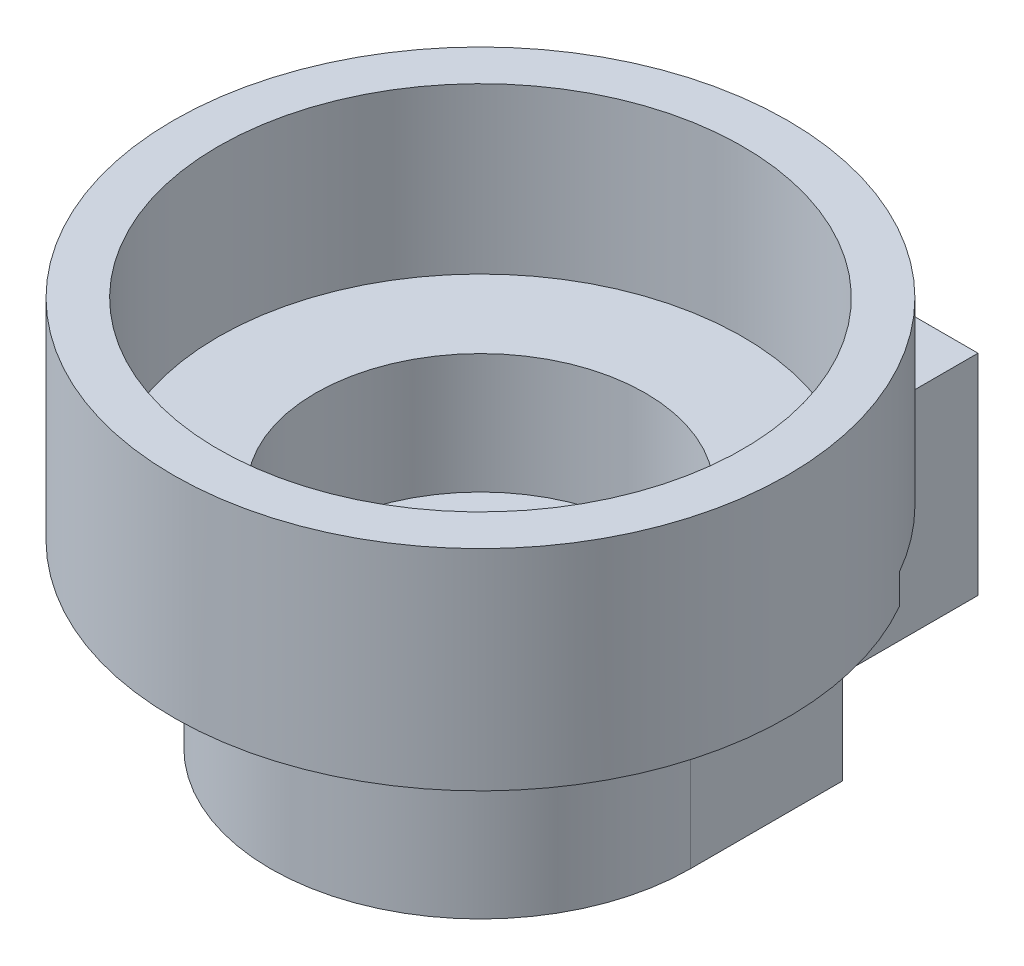
ISO-10303-21;
HEADER;
FILE_DESCRIPTION(('STEP AP214'),'2;1');
FILE_NAME('part.step','',(''),(''),'','','');
FILE_SCHEMA(('AUTOMOTIVE_DESIGN { 1 0 10303 214 1 1 1 1 }'));
ENDSEC;
DATA;
#1=APPLICATION_CONTEXT('core data for automotive mechanical design processes');
#2=APPLICATION_PROTOCOL_DEFINITION('international standard','automotive_design',2000,#1);
#3=PRODUCT_CONTEXT('',#1,'mechanical');
#4=PRODUCT('Part','Part','',(#3));
#5=PRODUCT_RELATED_PRODUCT_CATEGORY('part','',(#4));
#6=PRODUCT_DEFINITION_FORMATION('','',#4);
#7=PRODUCT_DEFINITION_CONTEXT('part definition',#1,'design');
#8=PRODUCT_DEFINITION('design','',#6,#7);
#9=PRODUCT_DEFINITION_SHAPE('','',#8);
#10=(LENGTH_UNIT() NAMED_UNIT(*) SI_UNIT(.MILLI.,.METRE.));
#11=(NAMED_UNIT(*) PLANE_ANGLE_UNIT() SI_UNIT($,.RADIAN.));
#12=(NAMED_UNIT(*) SI_UNIT($,.STERADIAN.) SOLID_ANGLE_UNIT());
#13=UNCERTAINTY_MEASURE_WITH_UNIT(LENGTH_MEASURE(1.E-05),#10,'distance_accuracy_value','');
#14=(GEOMETRIC_REPRESENTATION_CONTEXT(3) GLOBAL_UNCERTAINTY_ASSIGNED_CONTEXT((#13)) GLOBAL_UNIT_ASSIGNED_CONTEXT((#10,
#11,#12)) REPRESENTATION_CONTEXT('',''));
#15=CARTESIAN_POINT('',(0.,0.,0.));
#16=DIRECTION('',(0.,0.,1.));
#17=DIRECTION('',(1.,0.,0.));
#18=AXIS2_PLACEMENT_3D('',#15,#16,#17);
#19=CARTESIAN_POINT('',(-14.000000152,-37.8042327924268,-25.4));
#20=DIRECTION('',(0.,0.,1.));
#21=DIRECTION('',(1.,0.,0.));
#22=AXIS2_PLACEMENT_3D('',#19,#20,#21);
#23=PLANE('',#22);
#24=DIRECTION('',(0.,-1.,0.));
#25=VECTOR('',#24,1.);
#26=CARTESIAN_POINT('',(7.800000084,13.999999876,-25.4));
#27=LINE('',#26,#25);
#28=CARTESIAN_POINT('',(7.800000084,13.999999876,-25.4));
#29=VERTEX_POINT('',#28);
#30=CARTESIAN_POINT('',(7.800000084,0.,-25.4));
#31=VERTEX_POINT('',#30);
#32=EDGE_CURVE('E121',#29,#31,#27,.T.);
#33=ORIENTED_EDGE('',*,*,#32,.T.);
#34=DIRECTION('',(1.,0.,0.));
#35=VECTOR('',#34,1.);
#36=CARTESIAN_POINT('',(-14.000000152,0.,-25.4));
#37=LINE('',#36,#35);
#38=CARTESIAN_POINT('',(-7.800000084,0.,-25.4));
#39=VERTEX_POINT('',#38);
#40=EDGE_CURVE('E170',#39,#31,#37,.T.);
#41=ORIENTED_EDGE('',*,*,#40,.F.);
#42=DIRECTION('',(0.,-1.,0.));
#43=VECTOR('',#42,1.);
#44=CARTESIAN_POINT('',(-7.800000084,13.999999876,-25.4));
#45=LINE('',#44,#43);
#46=CARTESIAN_POINT('',(-7.800000084,13.999999876,-25.4));
#47=VERTEX_POINT('',#46);
#48=EDGE_CURVE('E146',#47,#39,#45,.T.);
#49=ORIENTED_EDGE('',*,*,#48,.F.);
#50=DIRECTION('',(-1.,0.,0.));
#51=VECTOR('',#50,1.);
#52=CARTESIAN_POINT('',(14.000000152,13.999999876,-25.4));
#53=LINE('',#52,#51);
#54=EDGE_CURVE('E140',#29,#47,#53,.T.);
#55=ORIENTED_EDGE('',*,*,#54,.F.);
#56=EDGE_LOOP('',(#33,#41,#49,#55));
#57=FACE_BOUND('',#56,.T.);
#58=ADVANCED_FACE('F37',(#57),#23,.F.);
#59=CARTESIAN_POINT('',(0.,13.999999876,0.));
#60=DIRECTION('',(0.,1.,0.));
#61=DIRECTION('',(0.,0.,1.));
#62=AXIS2_PLACEMENT_3D('',#59,#60,#61);
#63=PLANE('',#62);
#64=CARTESIAN_POINT('',(0.,13.999999876,0.));
#65=DIRECTION('',(0.,-1.,0.));
#66=DIRECTION('',(0.,0.,1.));
#67=AXIS2_PLACEMENT_3D('',#64,#65,#66);
#68=CIRCLE('',#67,20.500000052);
#69=CARTESIAN_POINT('',(-7.800000084,13.999999876,-18.9581117419853));
#70=VERTEX_POINT('',#69);
#71=CARTESIAN_POINT('',(7.800000084,13.999999876,-18.9581117419853));
#72=VERTEX_POINT('',#71);
#73=EDGE_CURVE('E142',#70,#72,#68,.T.);
#74=ORIENTED_EDGE('',*,*,#73,.T.);
#75=DIRECTION('',(0.,0.,-1.));
#76=VECTOR('',#75,1.);
#77=CARTESIAN_POINT('',(7.80000008400001,13.999999876,-10.16));
#78=LINE('',#77,#76);
#79=EDGE_CURVE('E126',#72,#29,#78,.T.);
#80=ORIENTED_EDGE('',*,*,#79,.T.);
#81=ORIENTED_EDGE('',*,*,#54,.T.);
#82=DIRECTION('',(0.,0.,1.));
#83=VECTOR('',#82,1.);
#84=CARTESIAN_POINT('',(-7.80000008400001,13.999999876,0.));
#85=LINE('',#84,#83);
#86=EDGE_CURVE('E207',#47,#70,#85,.T.);
#87=ORIENTED_EDGE('',*,*,#86,.T.);
#88=EDGE_LOOP('',(#74,#80,#81,#87));
#89=FACE_BOUND('',#88,.T.);
#90=ADVANCED_FACE('F138',(#89),#63,.T.);
#91=CARTESIAN_POINT('',(0.,6.999999906,0.));
#92=DIRECTION('',(0.,1.,0.));
#93=DIRECTION('',(-1.,0.,0.));
#94=AXIS2_PLACEMENT_3D('',#91,#92,#93);
#95=CYLINDRICAL_SURFACE('',#94,20.500000052);
#96=CARTESIAN_POINT('',(0.,25.999999876,0.));
#97=DIRECTION('',(0.,1.,0.));
#98=DIRECTION('',(-1.,0.,0.));
#99=AXIS2_PLACEMENT_3D('',#96,#97,#98);
#100=CIRCLE('',#99,20.500000052);
#101=CARTESIAN_POINT('',(-20.500000052,25.999999876,0.));
#102=VERTEX_POINT('',#101);
#103=EDGE_CURVE('E195',#102,#102,#100,.T.);
#104=ORIENTED_EDGE('',*,*,#103,.F.);
#105=EDGE_LOOP('',(#104));
#106=FACE_BOUND('',#105,.T.);
#107=CARTESIAN_POINT('',(0.,11.999999876,0.));
#108=DIRECTION('',(0.,1.,0.));
#109=DIRECTION('',(-1.,0.,0.));
#110=AXIS2_PLACEMENT_3D('',#107,#108,#109);
#111=CIRCLE('',#110,20.500000052);
#112=CARTESIAN_POINT('',(-17.8051790817167,11.999999876,-10.16));
#113=VERTEX_POINT('',#112);
#114=CARTESIAN_POINT('',(17.8051790817166,11.999999876,-10.16));
#115=VERTEX_POINT('',#114);
#116=EDGE_CURVE('E198',#113,#115,#111,.T.);
#117=ORIENTED_EDGE('',*,*,#116,.T.);
#118=DIRECTION('',(0.,1.,0.));
#119=VECTOR('',#118,1.);
#120=CARTESIAN_POINT('',(17.8051790817167,6.999999906,-10.16));
#121=LINE('',#120,#119);
#122=CARTESIAN_POINT('',(17.8051790817166,13.999999876,-10.16));
#123=VERTEX_POINT('',#122);
#124=EDGE_CURVE('E323',#115,#123,#121,.T.);
#125=ORIENTED_EDGE('',*,*,#124,.T.);
#126=CARTESIAN_POINT('',(0.,13.999999876,0.));
#127=DIRECTION('',(0.,-1.,0.));
#128=DIRECTION('',(0.,0.,-1.));
#129=AXIS2_PLACEMENT_3D('',#126,#127,#128);
#130=CIRCLE('',#129,20.500000052);
#131=EDGE_CURVE('E320',#123,#72,#130,.F.);
#132=ORIENTED_EDGE('',*,*,#131,.T.);
#133=ORIENTED_EDGE('',*,*,#73,.F.);
#134=CARTESIAN_POINT('',(-17.8051790817167,13.999999876,-10.16));
#135=VERTEX_POINT('',#134);
#136=EDGE_CURVE('E148',#135,#70,#68,.T.);
#137=ORIENTED_EDGE('',*,*,#136,.F.);
#138=DIRECTION('',(0.,1.,0.));
#139=VECTOR('',#138,1.);
#140=CARTESIAN_POINT('',(-17.8051790817167,6.999999906,-10.16));
#141=LINE('',#140,#139);
#142=EDGE_CURVE('E340',#113,#135,#141,.T.);
#143=ORIENTED_EDGE('',*,*,#142,.F.);
#144=EDGE_LOOP('',(#117,#125,#132,#133,#137,#143));
#145=FACE_BOUND('',#144,.T.);
#146=ADVANCED_FACE('F249',(#106,#145),#95,.T.);
#147=CARTESIAN_POINT('',(-14.000000152,11.999999876,0.));
#148=DIRECTION('',(0.,-1.,0.));
#149=DIRECTION('',(1.,0.,0.));
#150=AXIS2_PLACEMENT_3D('',#147,#148,#149);
#151=PLANE('',#150);
#152=DIRECTION('',(0.,0.,1.));
#153=VECTOR('',#152,1.);
#154=CARTESIAN_POINT('',(14.000000152,11.999999876,-25.4));
#155=LINE('',#154,#153);
#156=CARTESIAN_POINT('',(14.000000152,11.999999876,-10.16));
#157=VERTEX_POINT('',#156);
#158=CARTESIAN_POINT('',(14.000000152,11.999999876,0.));
#159=VERTEX_POINT('',#158);
#160=EDGE_CURVE('E163',#157,#159,#155,.T.);
#161=ORIENTED_EDGE('',*,*,#160,.F.);
#162=DIRECTION('',(1.,0.,0.));
#163=VECTOR('',#162,1.);
#164=CARTESIAN_POINT('',(-14.000000152,11.999999876,-10.16));
#165=LINE('',#164,#163);
#166=EDGE_CURVE('E51',#157,#115,#165,.T.);
#167=ORIENTED_EDGE('',*,*,#166,.T.);
#168=ORIENTED_EDGE('',*,*,#116,.F.);
#169=DIRECTION('',(-1.,0.,0.));
#170=VECTOR('',#169,1.);
#171=CARTESIAN_POINT('',(-14.000000152,11.999999876,-10.16));
#172=LINE('',#171,#170);
#173=CARTESIAN_POINT('',(-14.000000152,11.999999876,-10.16));
#174=VERTEX_POINT('',#173);
#175=EDGE_CURVE('E299',#174,#113,#172,.T.);
#176=ORIENTED_EDGE('',*,*,#175,.F.);
#177=DIRECTION('',(0.,0.,-1.));
#178=VECTOR('',#177,1.);
#179=CARTESIAN_POINT('',(-14.000000152,11.999999876,0.));
#180=LINE('',#179,#178);
#181=CARTESIAN_POINT('',(-14.000000152,11.999999876,0.));
#182=VERTEX_POINT('',#181);
#183=EDGE_CURVE('E166',#182,#174,#180,.T.);
#184=ORIENTED_EDGE('',*,*,#183,.F.);
#185=CARTESIAN_POINT('',(0.,11.999999876,0.));
#186=DIRECTION('',(0.,1.,0.));
#187=DIRECTION('',(-1.,0.,0.));
#188=AXIS2_PLACEMENT_3D('',#185,#186,#187);
#189=CIRCLE('',#188,14.000000152);
#190=EDGE_CURVE('E201',#182,#159,#189,.T.);
#191=ORIENTED_EDGE('',*,*,#190,.T.);
#192=EDGE_LOOP('',(#161,#167,#168,#176,#184,#191));
#193=FACE_BOUND('',#192,.T.);
#194=ADVANCED_FACE('F281',(#193),#151,.T.);
#195=CARTESIAN_POINT('',(0.,0.,0.));
#196=DIRECTION('',(0.,-1.,0.));
#197=DIRECTION('',(1.,0.,0.));
#198=AXIS2_PLACEMENT_3D('',#195,#196,#197);
#199=PLANE('',#198);
#200=CARTESIAN_POINT('',(0.,0.,-18.1));
#201=DIRECTION('',(0.,-1.,0.));
#202=DIRECTION('',(0.,0.,-1.));
#203=AXIS2_PLACEMENT_3D('',#200,#201,#202);
#204=CIRCLE('',#203,4.62499994);
#205=CARTESIAN_POINT('',(0.,0.,-22.72499994));
#206=VERTEX_POINT('',#205);
#207=EDGE_CURVE('E160',#206,#206,#204,.T.);
#208=ORIENTED_EDGE('',*,*,#207,.F.);
#209=EDGE_LOOP('',(#208));
#210=FACE_BOUND('',#209,.T.);
#211=CARTESIAN_POINT('',(0.,0.,0.));
#212=DIRECTION('',(0.,-1.,0.));
#213=DIRECTION('',(0.,0.,-1.));
#214=AXIS2_PLACEMENT_3D('',#211,#212,#213);
#215=CIRCLE('',#214,4.15);
#216=CARTESIAN_POINT('',(0.,0.,-4.15));
#217=VERTEX_POINT('',#216);
#218=EDGE_CURVE('E172',#217,#217,#215,.T.);
#219=ORIENTED_EDGE('',*,*,#218,.F.);
#220=EDGE_LOOP('',(#219));
#221=FACE_BOUND('',#220,.T.);
#222=DIRECTION('',(0.,0.,1.));
#223=VECTOR('',#222,1.);
#224=CARTESIAN_POINT('',(7.800000084,0.,-25.4));
#225=LINE('',#224,#223);
#226=CARTESIAN_POINT('',(7.80000008400001,0.,-10.16));
#227=VERTEX_POINT('',#226);
#228=EDGE_CURVE('E130',#31,#227,#225,.T.);
#229=ORIENTED_EDGE('',*,*,#228,.T.);
#230=DIRECTION('',(1.,0.,0.));
#231=VECTOR('',#230,1.);
#232=CARTESIAN_POINT('',(7.80000008400001,0.,-10.16));
#233=LINE('',#232,#231);
#234=CARTESIAN_POINT('',(14.000000152,0.,-10.16));
#235=VERTEX_POINT('',#234);
#236=EDGE_CURVE('E307',#227,#235,#233,.T.);
#237=ORIENTED_EDGE('',*,*,#236,.T.);
#238=DIRECTION('',(0.,0.,1.));
#239=VECTOR('',#238,1.);
#240=CARTESIAN_POINT('',(14.000000152,0.,-25.4));
#241=LINE('',#240,#239);
#242=CARTESIAN_POINT('',(14.000000152,0.,0.));
#243=VERTEX_POINT('',#242);
#244=EDGE_CURVE('E165',#235,#243,#241,.T.);
#245=ORIENTED_EDGE('',*,*,#244,.T.);
#246=CARTESIAN_POINT('',(0.,0.,0.));
#247=DIRECTION('',(0.,1.,0.));
#248=DIRECTION('',(-1.,0.,0.));
#249=AXIS2_PLACEMENT_3D('',#246,#247,#248);
#250=CIRCLE('',#249,14.000000152);
#251=CARTESIAN_POINT('',(-14.000000152,0.,0.));
#252=VERTEX_POINT('',#251);
#253=EDGE_CURVE('E204',#252,#243,#250,.T.);
#254=ORIENTED_EDGE('',*,*,#253,.F.);
#255=DIRECTION('',(0.,0.,-1.));
#256=VECTOR('',#255,1.);
#257=CARTESIAN_POINT('',(-14.000000152,0.,0.));
#258=LINE('',#257,#256);
#259=CARTESIAN_POINT('',(-14.000000152,0.,-10.16));
#260=VERTEX_POINT('',#259);
#261=EDGE_CURVE('E173',#252,#260,#258,.T.);
#262=ORIENTED_EDGE('',*,*,#261,.T.);
#263=DIRECTION('',(-1.,0.,0.));
#264=VECTOR('',#263,1.);
#265=CARTESIAN_POINT('',(-7.80000008400001,0.,-10.16));
#266=LINE('',#265,#264);
#267=CARTESIAN_POINT('',(-7.80000008400001,0.,-10.16));
#268=VERTEX_POINT('',#267);
#269=EDGE_CURVE('E304',#268,#260,#266,.T.);
#270=ORIENTED_EDGE('',*,*,#269,.F.);
#271=DIRECTION('',(0.,0.,1.));
#272=VECTOR('',#271,1.);
#273=CARTESIAN_POINT('',(-7.800000084,0.,-25.4));
#274=LINE('',#273,#272);
#275=EDGE_CURVE('E327',#39,#268,#274,.T.);
#276=ORIENTED_EDGE('',*,*,#275,.F.);
#277=ORIENTED_EDGE('',*,*,#40,.T.);
#278=EDGE_LOOP('',(#229,#237,#245,#254,#262,#270,#276,#277));
#279=FACE_BOUND('',#278,.T.);
#280=ADVANCED_FACE('F39',(#210,#221,#279),#199,.T.);
#281=CARTESIAN_POINT('',(14.000000152,-37.8042327924268,-25.4));
#282=DIRECTION('',(-1.,0.,0.));
#283=DIRECTION('',(0.,0.,1.));
#284=AXIS2_PLACEMENT_3D('',#281,#282,#283);
#285=PLANE('',#284);
#286=DIRECTION('',(0.,-1.,0.));
#287=VECTOR('',#286,1.);
#288=CARTESIAN_POINT('',(14.000000152,-37.8042327924268,-10.16));
#289=LINE('',#288,#287);
#290=EDGE_CURVE('E11',#157,#235,#289,.T.);
#291=ORIENTED_EDGE('',*,*,#290,.F.);
#292=ORIENTED_EDGE('',*,*,#160,.T.);
#293=DIRECTION('',(0.,1.,0.));
#294=VECTOR('',#293,1.);
#295=CARTESIAN_POINT('',(14.000000152,-37.8042327924268,0.));
#296=LINE('',#295,#294);
#297=EDGE_CURVE('E159',#243,#159,#296,.T.);
#298=ORIENTED_EDGE('',*,*,#297,.F.);
#299=ORIENTED_EDGE('',*,*,#244,.F.);
#300=EDGE_LOOP('',(#291,#292,#298,#299));
#301=FACE_BOUND('',#300,.T.);
#302=ADVANCED_FACE('F228',(#301),#285,.F.);
#303=CARTESIAN_POINT('',(8.85999984800001,6.000000096,-18.1));
#304=DIRECTION('',(-1.,0.,0.));
#305=DIRECTION('',(0.,0.,1.));
#306=AXIS2_PLACEMENT_3D('',#303,#304,#305);
#307=CYLINDRICAL_SURFACE('',#306,2.);
#308=CARTESIAN_POINT('',(4.17020676285961,6.000000096,-16.1));
#309=CARTESIAN_POINT('',(4.17021163983924,5.89375997326636,-16.1000045829647));
#310=CARTESIAN_POINT('',(4.1743250987065,5.78734026441885,-16.1085187615526));
#311=CARTESIAN_POINT('',(4.19023022652036,5.57761006660127,-16.1422139766788));
#312=CARTESIAN_POINT('',(4.20204198519075,5.47430845479749,-16.1674386242193));
#313=CARTESIAN_POINT('',(4.23173968518089,5.27422237236717,-16.2333740086601));
#314=CARTESIAN_POINT('',(4.24959953172784,5.17741200937914,-16.2740183058657));
#315=CARTESIAN_POINT('',(4.2893414314627,4.99201041364822,-16.3694405333855));
#316=CARTESIAN_POINT('',(4.31122274818883,4.90341768045313,-16.4242158765865));
#317=CARTESIAN_POINT('',(4.35818378137381,4.73096701701942,-16.5502759578558));
#318=CARTESIAN_POINT('',(4.38337713754211,4.64772632497969,-16.62236316634));
#319=CARTESIAN_POINT('',(4.43319311065461,4.49405533650395,-16.7793182606846));
#320=CARTESIAN_POINT('',(4.45781549395535,4.42363020623894,-16.8641912756324));
#321=CARTESIAN_POINT('',(4.50511478819999,4.29435387393522,-17.0492399712531));
#322=CARTESIAN_POINT('',(4.52764435727019,4.23620867666126,-17.1499499796026));
#323=CARTESIAN_POINT('',(4.56681449093279,4.13795589426053,-17.3608738705256));
#324=CARTESIAN_POINT('',(4.58345786035989,4.09783971564682,-17.4710831953549));
#325=CARTESIAN_POINT('',(4.6081723955694,4.03905662990982,-17.6913855460604));
#326=CARTESIAN_POINT('',(4.61666831714877,4.01932218824603,-17.8011450779354));
#327=CARTESIAN_POINT('',(4.62568113079364,3.99840157792707,-18.0227239878221));
#328=CARTESIAN_POINT('',(4.62620152519173,3.9972072676496,-18.1345424400905));
#329=CARTESIAN_POINT('',(4.6194463814332,4.01286699417534,-18.3492577631724));
#330=CARTESIAN_POINT('',(4.61267892672944,4.02854472325143,-18.452259503555));
#331=CARTESIAN_POINT('',(4.59281878008508,4.07547160724627,-18.6540019109506));
#332=CARTESIAN_POINT('',(4.57972562042203,4.10672191360635,-18.7527422622883));
#333=CARTESIAN_POINT('',(4.54821545227629,4.18426080598978,-18.9449866947924));
#334=CARTESIAN_POINT('',(4.5297200475622,4.23077218039143,-19.0383875362917));
#335=CARTESIAN_POINT('',(4.4891900129578,4.33728382542244,-19.2163044381201));
#336=CARTESIAN_POINT('',(4.46715410691085,4.39728896294196,-19.300817276569));
#337=CARTESIAN_POINT('',(4.41977675364516,4.5343136650814,-19.4653074729519));
#338=CARTESIAN_POINT('',(4.3943113429625,4.61227247779695,-19.5444677908268));
#339=CARTESIAN_POINT('',(4.34415567144429,4.78037120421385,-19.6889612977603));
#340=CARTESIAN_POINT('',(4.31946576145156,4.87051653609753,-19.7542883031192));
#341=CARTESIAN_POINT('',(4.27273109503714,5.06469315748091,-19.8715921941488));
#342=CARTESIAN_POINT('',(4.25082109372126,5.16911973255959,-19.9229731697571));
#343=CARTESIAN_POINT('',(4.21376366016677,5.38633993844916,-20.0070808138182));
#344=CARTESIAN_POINT('',(4.19861096299053,5.4991269750322,-20.0398220109323));
#345=CARTESIAN_POINT('',(4.17811922383775,5.72166015418008,-20.0835555188735));
#346=CARTESIAN_POINT('',(4.17218074096146,5.83108808391668,-20.0958802186355));
#347=CARTESIAN_POINT('',(4.16907208841147,6.05058629403723,-20.1023692746621));
#348=CARTESIAN_POINT('',(4.17189847321034,6.16065630503498,-20.0965407670688));
#349=CARTESIAN_POINT('',(4.18537801108803,6.37002905380461,-20.0681070018497));
#350=CARTESIAN_POINT('',(4.19545883994091,6.46953999191593,-20.0467273582435));
#351=CARTESIAN_POINT('',(4.22155930718191,6.66346360006635,-19.9894560704207));
#352=CARTESIAN_POINT('',(4.23758040676264,6.75787500916738,-19.9535608554549));
#353=CARTESIAN_POINT('',(4.27460727040286,6.94355332677718,-19.8665443837767));
#354=CARTESIAN_POINT('',(4.29580067627235,7.03450122724724,-19.8148249238605));
#355=CARTESIAN_POINT('',(4.34053595727253,7.20688529471151,-19.6982080262344));
#356=CARTESIAN_POINT('',(4.36407889874976,7.2883171060559,-19.6333045909585));
#357=CARTESIAN_POINT('',(4.41338650419196,7.44690581070947,-19.4853665243456));
#358=CARTESIAN_POINT('',(4.43916248752463,7.52303787962208,-19.4012325497447));
#359=CARTESIAN_POINT('',(4.48811099273165,7.66031180814099,-19.2208091483959));
#360=CARTESIAN_POINT('',(4.51128322912308,7.72145202486115,-19.1245183911937));
#361=CARTESIAN_POINT('',(4.55265026561021,7.82712432636863,-18.9214522393322));
#362=CARTESIAN_POINT('',(4.57081571553718,7.87155901252603,-18.8146198064003));
#363=CARTESIAN_POINT('',(4.59988390165613,7.94147588558229,-18.5940018699717));
#364=CARTESIAN_POINT('',(4.61079133041436,7.96697031926562,-18.4802209110029));
#365=CARTESIAN_POINT('',(4.62353731403764,7.99665569557166,-18.2580578395126));
#366=CARTESIAN_POINT('',(4.62598926287303,8.0022882543031,-18.1499023964805));
#367=CARTESIAN_POINT('',(4.623284632355,7.99603281126003,-17.9342088873245));
#368=CARTESIAN_POINT('',(4.61812957635022,7.98414831738159,-17.8266707019202));
#369=CARTESIAN_POINT('',(4.60112464568227,7.94422963694899,-17.6197603474726));
#370=CARTESIAN_POINT('',(4.58955345528633,7.91686681349204,-17.5202337762464));
#371=CARTESIAN_POINT('',(4.56102997441975,7.84752965446456,-17.3272424051909));
#372=CARTESIAN_POINT('',(4.54407670451198,7.8055526592555,-17.2337787124226));
#373=CARTESIAN_POINT('',(4.50544559902745,7.70605117417789,-17.0508461887043));
#374=CARTESIAN_POINT('',(4.48358720814489,7.64790365016552,-16.9617553159924));
#375=CARTESIAN_POINT('',(4.4376895998535,7.51859020221277,-16.7942074694256));
#376=CARTESIAN_POINT('',(4.41364950574626,7.44741903305399,-16.7157548023074));
#377=CARTESIAN_POINT('',(4.36383938328884,7.28787678398011,-16.5656464163787));
#378=CARTESIAN_POINT('',(4.33807321125927,7.1986218153207,-16.4949255709569));
#379=CARTESIAN_POINT('',(4.28950156582462,7.0087634202493,-16.369290973171));
#380=CARTESIAN_POINT('',(4.26669784668928,6.90815333499905,-16.3143865635788));
#381=CARTESIAN_POINT('',(4.22697571565919,6.69808246237562,-16.2222806395069));
#382=CARTESIAN_POINT('',(4.21005421988504,6.58862634992985,-16.1850698450013));
#383=CARTESIAN_POINT('',(4.18461029702608,6.36420921030614,-16.1300742726874));
#384=CARTESIAN_POINT('',(4.17605970439929,6.24926801760439,-16.1122243294692));
#385=CARTESIAN_POINT('',(4.17163582063607,6.111470940116,-16.102983157339));
#386=CARTESIAN_POINT('',(4.17110098896061,6.08919710299483,-16.101865501688));
#387=CARTESIAN_POINT('',(4.17038594464056,6.04461818348998,-16.1003734348565));
#388=CARTESIAN_POINT('',(4.17020573857551,6.02231310053426,-16.0999990374662));
#389=CARTESIAN_POINT('',(4.17020676285961,6.000000096,-16.1));
#390=B_SPLINE_CURVE_WITH_KNOTS('',3,(#308,#309,#310,#311,#312,#313,#314,#315,#316,#317,#318,
#319,#320,#321,#322,#323,#324,#325,#326,#327,#328,#329,#330,#331,#332,#333,#334,#335,#336,#337,
#338,#339,#340,#341,#342,#343,#344,#345,#346,#347,#348,#349,#350,#351,#352,#353,#354,#355,#356,
#357,#358,#359,#360,#361,#362,#363,#364,#365,#366,#367,#368,#369,#370,#371,#372,#373,#374,#375,
#376,#377,#378,#379,#380,#381,#382,#383,#384,#385,#386,#387,#388,#389),.UNSPECIFIED.,.T.,.F.,(4,
2,2,2,2,2,2,2,2,2,2,2,2,2,2,2,2,2,2,2,2,2,2,2,2,2,2,2,2,2,2,2,2,2,2,2,2,2,2,2,4),(0.,
0.318626366498543,0.638087577764233,0.956187656649661,1.27422953902302,1.6116466258655,
1.94919943141035,2.30273692644682,2.65610572952748,2.98984867796665,3.32344506401758,
3.63520459308537,3.9469871771736,4.26354043518066,4.58020805031583,4.9206532165442,
5.2612502471357,5.61468334878863,5.96784059067453,6.29688385492055,6.62579778648278,
6.93126386426015,7.23680513073369,7.55573328756178,7.87480685528702,8.22226666958744,
8.56976454336474,8.91925812952251,9.26852553565371,9.591852174339,9.9151140736993,
10.2253252968048,10.5355930049026,10.8600447740395,11.1846275035168,11.5332697550238,
11.8821175292597,12.2307821358955,12.5782695183904,12.6451875478046,12.7121068187682),.UNSPECIFIED.);
#391=CARTESIAN_POINT('',(4.17020676285961,6.000000096,-16.1));
#392=VERTEX_POINT('',#391);
#393=EDGE_CURVE('E151',#392,#392,#390,.T.);
#394=ORIENTED_EDGE('',*,*,#393,.F.);
#395=EDGE_LOOP('',(#394));
#396=FACE_BOUND('',#395,.T.);
#397=CARTESIAN_POINT('',(7.800000084,6.000000096,-18.1));
#398=DIRECTION('',(1.,0.,0.));
#399=DIRECTION('',(0.,0.,-1.));
#400=AXIS2_PLACEMENT_3D('',#397,#398,#399);
#401=CIRCLE('',#400,2.);
#402=CARTESIAN_POINT('',(7.800000084,6.000000096,-20.1));
#403=VERTEX_POINT('',#402);
#404=EDGE_CURVE('E313',#403,#403,#401,.F.);
#405=ORIENTED_EDGE('',*,*,#404,.F.);
#406=EDGE_LOOP('',(#405));
#407=FACE_BOUND('',#406,.T.);
#408=ADVANCED_FACE('F223',(#396,#407),#307,.F.);
#409=CARTESIAN_POINT('',(-4.17020676285961,6.000000096,-16.1));
#410=CARTESIAN_POINT('',(-4.17021163983924,6.10624021873364,-16.1000045829647));
#411=CARTESIAN_POINT('',(-4.1743250987065,6.21265992758115,-16.1085187615526));
#412=CARTESIAN_POINT('',(-4.19023022652036,6.42239012539873,-16.1422139766788));
#413=CARTESIAN_POINT('',(-4.20204198519075,6.52569173720251,-16.1674386242193));
#414=CARTESIAN_POINT('',(-4.23173968518089,6.72577781963283,-16.2333740086601));
#415=CARTESIAN_POINT('',(-4.24959953172784,6.82258818262086,-16.2740183058657));
#416=CARTESIAN_POINT('',(-4.2893414314627,7.00798977835178,-16.3694405333855));
#417=CARTESIAN_POINT('',(-4.31122274818883,7.09658251154687,-16.4242158765865));
#418=CARTESIAN_POINT('',(-4.35818378137381,7.26903317498058,-16.5502759578558));
#419=CARTESIAN_POINT('',(-4.38337713754212,7.35227386702031,-16.62236316634));
#420=CARTESIAN_POINT('',(-4.43319311065461,7.50594485549605,-16.7793182606846));
#421=CARTESIAN_POINT('',(-4.45781549395535,7.57636998576105,-16.8641912756324));
#422=CARTESIAN_POINT('',(-4.50511478819999,7.70564631806478,-17.0492399712531));
#423=CARTESIAN_POINT('',(-4.52764435727019,7.76379151533874,-17.1499499796026));
#424=CARTESIAN_POINT('',(-4.56681449093279,7.86204429773947,-17.3608738705256));
#425=CARTESIAN_POINT('',(-4.58345786035989,7.90216047635318,-17.4710831953549));
#426=CARTESIAN_POINT('',(-4.6081723955694,7.96094356209018,-17.6913855460604));
#427=CARTESIAN_POINT('',(-4.61666831714877,7.98067800375397,-17.8011450779354));
#428=CARTESIAN_POINT('',(-4.62568113079364,8.00159861407293,-18.0227239878221));
#429=CARTESIAN_POINT('',(-4.62620152519173,8.0027929243504,-18.1345424400905));
#430=CARTESIAN_POINT('',(-4.6194463814332,7.98713319782466,-18.3492577631724));
#431=CARTESIAN_POINT('',(-4.61267892672944,7.97145546874857,-18.452259503555));
#432=CARTESIAN_POINT('',(-4.59281878008508,7.92452858475373,-18.6540019109506));
#433=CARTESIAN_POINT('',(-4.57972562042203,7.89327827839365,-18.7527422622883));
#434=CARTESIAN_POINT('',(-4.54821545227629,7.81573938601022,-18.9449866947924));
#435=CARTESIAN_POINT('',(-4.5297200475622,7.76922801160857,-19.0383875362917));
#436=CARTESIAN_POINT('',(-4.4891900129578,7.66271636657756,-19.2163044381201));
#437=CARTESIAN_POINT('',(-4.46715410691085,7.60271122905803,-19.300817276569));
#438=CARTESIAN_POINT('',(-4.41977675364516,7.4656865269186,-19.4653074729519));
#439=CARTESIAN_POINT('',(-4.3943113429625,7.38772771420305,-19.5444677908268));
#440=CARTESIAN_POINT('',(-4.34415567144429,7.21962898778615,-19.6889612977603));
#441=CARTESIAN_POINT('',(-4.31946576145156,7.12948365590248,-19.7542883031192));
#442=CARTESIAN_POINT('',(-4.27273109503714,6.93530703451909,-19.8715921941488));
#443=CARTESIAN_POINT('',(-4.25082109372126,6.83088045944041,-19.9229731697571));
#444=CARTESIAN_POINT('',(-4.21376366016677,6.61366025355084,-20.0070808138182));
#445=CARTESIAN_POINT('',(-4.19861096299053,6.5008732169678,-20.0398220109323));
#446=CARTESIAN_POINT('',(-4.17811922383775,6.27834003781992,-20.0835555188735));
#447=CARTESIAN_POINT('',(-4.17218074096146,6.16891210808332,-20.0958802186355));
#448=CARTESIAN_POINT('',(-4.16907208841147,5.94941389796278,-20.1023692746622));
#449=CARTESIAN_POINT('',(-4.17189847321033,5.83934388696502,-20.0965407670688));
#450=CARTESIAN_POINT('',(-4.18537801108803,5.62997113819539,-20.0681070018497));
#451=CARTESIAN_POINT('',(-4.19545883994091,5.53046020008407,-20.0467273582435));
#452=CARTESIAN_POINT('',(-4.22155930718191,5.33653659193365,-19.9894560704207));
#453=CARTESIAN_POINT('',(-4.23758040676264,5.24212518283262,-19.9535608554549));
#454=CARTESIAN_POINT('',(-4.27460727040286,5.05644686522283,-19.8665443837767));
#455=CARTESIAN_POINT('',(-4.29580067627235,4.96549896475276,-19.8148249238605));
#456=CARTESIAN_POINT('',(-4.34053595727253,4.79311489728849,-19.6982080262344));
#457=CARTESIAN_POINT('',(-4.36407889874976,4.7116830859441,-19.6333045909585));
#458=CARTESIAN_POINT('',(-4.41338650419196,4.55309438129053,-19.4853665243456));
#459=CARTESIAN_POINT('',(-4.43916248752463,4.47696231237792,-19.4012325497447));
#460=CARTESIAN_POINT('',(-4.48811099273165,4.33968838385902,-19.2208091483959));
#461=CARTESIAN_POINT('',(-4.51128322912308,4.27854816713886,-19.1245183911937));
#462=CARTESIAN_POINT('',(-4.55265026561021,4.17287586563137,-18.9214522393322));
#463=CARTESIAN_POINT('',(-4.57081571553718,4.12844117947397,-18.8146198064003));
#464=CARTESIAN_POINT('',(-4.59988390165613,4.05852430641771,-18.5940018699717));
#465=CARTESIAN_POINT('',(-4.61079133041436,4.03302987273438,-18.4802209110029));
#466=CARTESIAN_POINT('',(-4.62353731403764,4.00334449642834,-18.2580578395126));
#467=CARTESIAN_POINT('',(-4.62598926287303,3.9977119376969,-18.1499023964805));
#468=CARTESIAN_POINT('',(-4.623284632355,4.00396738073997,-17.9342088873245));
#469=CARTESIAN_POINT('',(-4.61812957635022,4.01585187461841,-17.8266707019202));
#470=CARTESIAN_POINT('',(-4.60112464568227,4.05577055505101,-17.6197603474726));
#471=CARTESIAN_POINT('',(-4.58955345528633,4.08313337850795,-17.5202337762464));
#472=CARTESIAN_POINT('',(-4.56102997441975,4.15247053753544,-17.3272424051909));
#473=CARTESIAN_POINT('',(-4.54407670451198,4.1944475327445,-17.2337787124226));
#474=CARTESIAN_POINT('',(-4.50544559902745,4.29394901782211,-17.0508461887043));
#475=CARTESIAN_POINT('',(-4.48358720814489,4.35209654183448,-16.9617553159924));
#476=CARTESIAN_POINT('',(-4.4376895998535,4.48140998978723,-16.7942074694256));
#477=CARTESIAN_POINT('',(-4.41364950574626,4.55258115894601,-16.7157548023074));
#478=CARTESIAN_POINT('',(-4.36383938328884,4.7121234080199,-16.5656464163787));
#479=CARTESIAN_POINT('',(-4.33807321125927,4.8013783766793,-16.4949255709569));
#480=CARTESIAN_POINT('',(-4.28950156582462,4.9912367717507,-16.369290973171));
#481=CARTESIAN_POINT('',(-4.26669784668928,5.09184685700095,-16.3143865635788));
#482=CARTESIAN_POINT('',(-4.22697571565919,5.30191772962438,-16.2222806395069));
#483=CARTESIAN_POINT('',(-4.21005421988505,5.41137384207015,-16.1850698450013));
#484=CARTESIAN_POINT('',(-4.18461029702608,5.63579098169386,-16.1300742726874));
#485=CARTESIAN_POINT('',(-4.17605970439929,5.75073217439561,-16.1122243294692));
#486=CARTESIAN_POINT('',(-4.17163582063607,5.888529251884,-16.102983157339));
#487=CARTESIAN_POINT('',(-4.17110098896061,5.91080308900517,-16.101865501688));
#488=CARTESIAN_POINT('',(-4.17038594464056,5.95538200851002,-16.1003734348565));
#489=CARTESIAN_POINT('',(-4.17020573857551,5.97768709146574,-16.0999990374662));
#490=CARTESIAN_POINT('',(-4.17020676285961,6.000000096,-16.1));
#491=B_SPLINE_CURVE_WITH_KNOTS('',3,(#409,#410,#411,#412,#413,#414,#415,#416,#417,#418,#419,
#420,#421,#422,#423,#424,#425,#426,#427,#428,#429,#430,#431,#432,#433,#434,#435,#436,#437,#438,
#439,#440,#441,#442,#443,#444,#445,#446,#447,#448,#449,#450,#451,#452,#453,#454,#455,#456,#457,
#458,#459,#460,#461,#462,#463,#464,#465,#466,#467,#468,#469,#470,#471,#472,#473,#474,#475,#476,
#477,#478,#479,#480,#481,#482,#483,#484,#485,#486,#487,#488,#489,#490),.UNSPECIFIED.,.T.,.F.,(4,
2,2,2,2,2,2,2,2,2,2,2,2,2,2,2,2,2,2,2,2,2,2,2,2,2,2,2,2,2,2,2,2,2,2,2,2,2,2,2,4),(0.,
0.318626366498543,0.638087577764232,0.956187656649662,1.27422953902302,1.6116466258655,
1.94919943141035,2.30273692644682,2.65610572952748,2.98984867796666,3.32344506401757,
3.63520459308536,3.9469871771736,4.26354043518066,4.58020805031583,4.92065321654419,
5.2612502471357,5.61468334878863,5.96784059067453,6.29688385492055,6.62579778648278,
6.93126386426015,7.23680513073369,7.55573328756178,7.87480685528702,8.22226666958744,
8.56976454336474,8.91925812952251,9.2685255356537,9.591852174339,9.9151140736993,
10.2253252968048,10.5355930049026,10.8600447740395,11.1846275035168,11.5332697550238,
11.8821175292597,12.2307821358955,12.5782695183904,12.6451875478046,12.7121068187682),.UNSPECIFIED.);
#492=CARTESIAN_POINT('',(-4.17020676285961,6.000000096,-16.1));
#493=VERTEX_POINT('',#492);
#494=EDGE_CURVE('E147',#493,#493,#491,.T.);
#495=ORIENTED_EDGE('',*,*,#494,.F.);
#496=EDGE_LOOP('',(#495));
#497=FACE_BOUND('',#496,.T.);
#498=CARTESIAN_POINT('',(-7.800000084,6.000000096,-18.1));
#499=DIRECTION('',(-1.,0.,0.));
#500=DIRECTION('',(0.,0.,1.));
#501=AXIS2_PLACEMENT_3D('',#498,#499,#500);
#502=CIRCLE('',#501,2.);
#503=CARTESIAN_POINT('',(-7.800000084,6.000000096,-16.1));
#504=VERTEX_POINT('',#503);
#505=EDGE_CURVE('E336',#504,#504,#502,.F.);
#506=ORIENTED_EDGE('',*,*,#505,.F.);
#507=EDGE_LOOP('',(#506));
#508=FACE_BOUND('',#507,.T.);
#509=ADVANCED_FACE('F227',(#497,#508),#307,.F.);
#510=CARTESIAN_POINT('',(0.,6.999999906,0.));
#511=DIRECTION('',(0.,1.,0.));
#512=DIRECTION('',(-1.,0.,0.));
#513=AXIS2_PLACEMENT_3D('',#510,#511,#512);
#514=CYLINDRICAL_SURFACE('',#513,14.000000152);
#515=ORIENTED_EDGE('',*,*,#190,.F.);
#516=DIRECTION('',(0.,1.,0.));
#517=VECTOR('',#516,1.);
#518=CARTESIAN_POINT('',(-14.000000152,-37.8042327924268,0.));
#519=LINE('',#518,#517);
#520=EDGE_CURVE('E169',#252,#182,#519,.T.);
#521=ORIENTED_EDGE('',*,*,#520,.F.);
#522=ORIENTED_EDGE('',*,*,#253,.T.);
#523=ORIENTED_EDGE('',*,*,#297,.T.);
#524=EDGE_LOOP('',(#515,#521,#522,#523));
#525=FACE_BOUND('',#524,.T.);
#526=ADVANCED_FACE('F277',(#525),#514,.T.);
#527=CARTESIAN_POINT('',(-20.500000052,25.999999876,0.));
#528=DIRECTION('',(0.,1.,0.));
#529=DIRECTION('',(-1.,0.,0.));
#530=AXIS2_PLACEMENT_3D('',#527,#528,#529);
#531=PLANE('',#530);
#532=ORIENTED_EDGE('',*,*,#103,.T.);
#533=EDGE_LOOP('',(#532));
#534=FACE_BOUND('',#533,.T.);
#535=CARTESIAN_POINT('',(0.,25.999999876,0.));
#536=DIRECTION('',(0.,1.,0.));
#537=DIRECTION('',(-1.,0.,0.));
#538=AXIS2_PLACEMENT_3D('',#535,#536,#537);
#539=CIRCLE('',#538,17.500000052);
#540=CARTESIAN_POINT('',(-17.500000052,25.999999876,0.));
#541=VERTEX_POINT('',#540);
#542=EDGE_CURVE('E192',#541,#541,#539,.T.);
#543=ORIENTED_EDGE('',*,*,#542,.F.);
#544=EDGE_LOOP('',(#543));
#545=FACE_BOUND('',#544,.T.);
#546=ADVANCED_FACE('F273',(#534,#545),#531,.T.);
#547=CARTESIAN_POINT('',(0.,6.999999906,0.));
#548=DIRECTION('',(0.,1.,0.));
#549=DIRECTION('',(-1.,0.,0.));
#550=AXIS2_PLACEMENT_3D('',#547,#548,#549);
#551=CYLINDRICAL_SURFACE('',#550,17.500000052);
#552=ORIENTED_EDGE('',*,*,#542,.T.);
#553=EDGE_LOOP('',(#552));
#554=FACE_BOUND('',#553,.T.);
#555=CARTESIAN_POINT('',(0.,14.999999876,0.));
#556=DIRECTION('',(0.,1.,0.));
#557=DIRECTION('',(-1.,0.,0.));
#558=AXIS2_PLACEMENT_3D('',#555,#556,#557);
#559=CIRCLE('',#558,17.500000052);
#560=CARTESIAN_POINT('',(-17.500000052,14.999999876,0.));
#561=VERTEX_POINT('',#560);
#562=EDGE_CURVE('E189',#561,#561,#559,.T.);
#563=ORIENTED_EDGE('',*,*,#562,.F.);
#564=EDGE_LOOP('',(#563));
#565=FACE_BOUND('',#564,.T.);
#566=ADVANCED_FACE('F269',(#554,#565),#551,.F.);
#567=CARTESIAN_POINT('',(-17.500000052,14.999999876,0.));
#568=DIRECTION('',(0.,1.,0.));
#569=DIRECTION('',(-1.,0.,0.));
#570=AXIS2_PLACEMENT_3D('',#567,#568,#569);
#571=PLANE('',#570);
#572=ORIENTED_EDGE('',*,*,#562,.T.);
#573=EDGE_LOOP('',(#572));
#574=FACE_BOUND('',#573,.T.);
#575=CARTESIAN_POINT('',(0.,14.999999876,0.));
#576=DIRECTION('',(0.,1.,0.));
#577=DIRECTION('',(-1.,0.,0.));
#578=AXIS2_PLACEMENT_3D('',#575,#576,#577);
#579=CIRCLE('',#578,11.000000152);
#580=CARTESIAN_POINT('',(-11.000000152,14.999999876,0.));
#581=VERTEX_POINT('',#580);
#582=EDGE_CURVE('E186',#581,#581,#579,.T.);
#583=ORIENTED_EDGE('',*,*,#582,.F.);
#584=EDGE_LOOP('',(#583));
#585=FACE_BOUND('',#584,.T.);
#586=ADVANCED_FACE('F265',(#574,#585),#571,.T.);
#587=CARTESIAN_POINT('',(0.,6.999999906,0.));
#588=DIRECTION('',(0.,1.,0.));
#589=DIRECTION('',(-1.,0.,0.));
#590=AXIS2_PLACEMENT_3D('',#587,#588,#589);
#591=CYLINDRICAL_SURFACE('',#590,11.000000152);
#592=ORIENTED_EDGE('',*,*,#582,.T.);
#593=EDGE_LOOP('',(#592));
#594=FACE_BOUND('',#593,.T.);
#595=CARTESIAN_POINT('',(0.,6.999999906,0.));
#596=DIRECTION('',(0.,1.,0.));
#597=DIRECTION('',(-1.,0.,0.));
#598=AXIS2_PLACEMENT_3D('',#595,#596,#597);
#599=CIRCLE('',#598,11.000000152);
#600=CARTESIAN_POINT('',(-11.000000152,6.999999906,0.));
#601=VERTEX_POINT('',#600);
#602=EDGE_CURVE('E183',#601,#601,#599,.T.);
#603=ORIENTED_EDGE('',*,*,#602,.F.);
#604=EDGE_LOOP('',(#603));
#605=FACE_BOUND('',#604,.T.);
#606=ADVANCED_FACE('F261',(#594,#605),#591,.F.);
#607=CARTESIAN_POINT('',(-11.000000152,6.999999906,0.));
#608=DIRECTION('',(0.,1.,0.));
#609=DIRECTION('',(-1.,0.,0.));
#610=AXIS2_PLACEMENT_3D('',#607,#608,#609);
#611=PLANE('',#610);
#612=CARTESIAN_POINT('',(0.,6.999999906,0.));
#613=DIRECTION('',(0.,1.,0.));
#614=DIRECTION('',(-1.,0.,0.));
#615=AXIS2_PLACEMENT_3D('',#612,#613,#614);
#616=CIRCLE('',#615,4.15);
#617=CARTESIAN_POINT('',(-4.15,6.999999906,0.));
#618=VERTEX_POINT('',#617);
#619=EDGE_CURVE('E182',#618,#618,#616,.T.);
#620=ORIENTED_EDGE('',*,*,#619,.F.);
#621=EDGE_LOOP('',(#620));
#622=FACE_BOUND('',#621,.T.);
#623=ORIENTED_EDGE('',*,*,#602,.T.);
#624=EDGE_LOOP('',(#623));
#625=FACE_BOUND('',#624,.T.);
#626=ADVANCED_FACE('F257',(#622,#625),#611,.T.);
#627=CARTESIAN_POINT('',(0.,25.999999876,0.));
#628=DIRECTION('',(0.,-1.,0.));
#629=DIRECTION('',(0.,0.,-1.));
#630=AXIS2_PLACEMENT_3D('',#627,#628,#629);
#631=CYLINDRICAL_SURFACE('',#630,4.15);
#632=ORIENTED_EDGE('',*,*,#619,.T.);
#633=EDGE_LOOP('',(#632));
#634=FACE_BOUND('',#633,.T.);
#635=ORIENTED_EDGE('',*,*,#218,.T.);
#636=EDGE_LOOP('',(#635));
#637=FACE_BOUND('',#636,.T.);
#638=ADVANCED_FACE('F253',(#634,#637),#631,.F.);
#639=CARTESIAN_POINT('',(-14.000000152,-37.8042327924268,0.));
#640=DIRECTION('',(1.,0.,0.));
#641=DIRECTION('',(0.,0.,-1.));
#642=AXIS2_PLACEMENT_3D('',#639,#640,#641);
#643=PLANE('',#642);
#644=ORIENTED_EDGE('',*,*,#183,.T.);
#645=DIRECTION('',(0.,-1.,0.));
#646=VECTOR('',#645,1.);
#647=CARTESIAN_POINT('',(-14.000000152,-37.8042327924268,-10.16));
#648=LINE('',#647,#646);
#649=EDGE_CURVE('E45',#174,#260,#648,.T.);
#650=ORIENTED_EDGE('',*,*,#649,.T.);
#651=ORIENTED_EDGE('',*,*,#261,.F.);
#652=ORIENTED_EDGE('',*,*,#520,.T.);
#653=EDGE_LOOP('',(#644,#650,#651,#652));
#654=FACE_BOUND('',#653,.T.);
#655=ADVANCED_FACE('F242',(#654),#643,.F.);
#656=CARTESIAN_POINT('',(0.,10.62,-18.1));
#657=DIRECTION('',(0.,-1.,0.));
#658=DIRECTION('',(0.,0.,-1.));
#659=AXIS2_PLACEMENT_3D('',#656,#657,#658);
#660=CYLINDRICAL_SURFACE('',#659,4.62499994);
#661=ORIENTED_EDGE('',*,*,#393,.T.);
#662=EDGE_LOOP('',(#661));
#663=FACE_BOUND('',#662,.T.);
#664=ORIENTED_EDGE('',*,*,#494,.T.);
#665=EDGE_LOOP('',(#664));
#666=FACE_BOUND('',#665,.T.);
#667=CARTESIAN_POINT('',(0.,10.62,-18.1));
#668=DIRECTION('',(0.,-1.,0.));
#669=DIRECTION('',(0.,0.,-1.));
#670=AXIS2_PLACEMENT_3D('',#667,#668,#669);
#671=CIRCLE('',#670,4.62499994);
#672=CARTESIAN_POINT('',(0.,10.62,-22.72499994));
#673=VERTEX_POINT('',#672);
#674=EDGE_CURVE('E156',#673,#673,#671,.T.);
#675=ORIENTED_EDGE('',*,*,#674,.F.);
#676=EDGE_LOOP('',(#675));
#677=FACE_BOUND('',#676,.T.);
#678=ORIENTED_EDGE('',*,*,#207,.T.);
#679=EDGE_LOOP('',(#678));
#680=FACE_BOUND('',#679,.T.);
#681=ADVANCED_FACE('F219',(#663,#666,#677,#680),#660,.F.);
#682=CARTESIAN_POINT('',(0.,10.62,-18.1));
#683=DIRECTION('',(0.,-1.,0.));
#684=DIRECTION('',(0.,0.,-1.));
#685=AXIS2_PLACEMENT_3D('',#682,#683,#684);
#686=PLANE('',#685);
#687=ORIENTED_EDGE('',*,*,#674,.T.);
#688=EDGE_LOOP('',(#687));
#689=FACE_BOUND('',#688,.T.);
#690=ADVANCED_FACE('F231',(#689),#686,.T.);
#691=CARTESIAN_POINT('',(-7.80000008400001,0.,0.));
#692=DIRECTION('',(-1.,0.,0.));
#693=DIRECTION('',(0.,0.,1.));
#694=AXIS2_PLACEMENT_3D('',#691,#692,#693);
#695=PLANE('',#694);
#696=ORIENTED_EDGE('',*,*,#48,.T.);
#697=ORIENTED_EDGE('',*,*,#275,.T.);
#698=DIRECTION('',(0.,1.,0.));
#699=VECTOR('',#698,1.);
#700=CARTESIAN_POINT('',(-7.80000008400001,0.,-10.16));
#701=LINE('',#700,#699);
#702=CARTESIAN_POINT('',(-7.80000008400001,13.999999876,-10.16));
#703=VERTEX_POINT('',#702);
#704=EDGE_CURVE('E330',#268,#703,#701,.T.);
#705=ORIENTED_EDGE('',*,*,#704,.T.);
#706=DIRECTION('',(0.,0.,-1.));
#707=VECTOR('',#706,1.);
#708=CARTESIAN_POINT('',(-7.80000008400001,13.999999876,-10.16));
#709=LINE('',#708,#707);
#710=EDGE_CURVE('E59',#703,#70,#709,.T.);
#711=ORIENTED_EDGE('',*,*,#710,.T.);
#712=ORIENTED_EDGE('',*,*,#86,.F.);
#713=EDGE_LOOP('',(#696,#697,#705,#711,#712));
#714=FACE_BOUND('',#713,.T.);
#715=ORIENTED_EDGE('',*,*,#505,.T.);
#716=EDGE_LOOP('',(#715));
#717=FACE_BOUND('',#716,.T.);
#718=ADVANCED_FACE('F234',(#714,#717),#695,.T.);
#719=CARTESIAN_POINT('',(-7.80000008400001,13.999999876,-10.16));
#720=DIRECTION('',(0.,1.,0.));
#721=DIRECTION('',(0.,0.,1.));
#722=AXIS2_PLACEMENT_3D('',#719,#720,#721);
#723=PLANE('',#722);
#724=ORIENTED_EDGE('',*,*,#136,.T.);
#725=ORIENTED_EDGE('',*,*,#710,.F.);
#726=DIRECTION('',(-1.,0.,0.));
#727=VECTOR('',#726,1.);
#728=CARTESIAN_POINT('',(-7.80000008400001,13.999999876,-10.16));
#729=LINE('',#728,#727);
#730=EDGE_CURVE('E333',#703,#135,#729,.T.);
#731=ORIENTED_EDGE('',*,*,#730,.T.);
#732=EDGE_LOOP('',(#724,#725,#731));
#733=FACE_BOUND('',#732,.T.);
#734=ADVANCED_FACE('F240',(#733),#723,.F.);
#735=CARTESIAN_POINT('',(-7.80000008400001,0.,-10.16));
#736=DIRECTION('',(0.,0.,1.));
#737=DIRECTION('',(1.,0.,0.));
#738=AXIS2_PLACEMENT_3D('',#735,#736,#737);
#739=PLANE('',#738);
#740=ORIENTED_EDGE('',*,*,#142,.T.);
#741=ORIENTED_EDGE('',*,*,#730,.F.);
#742=ORIENTED_EDGE('',*,*,#704,.F.);
#743=ORIENTED_EDGE('',*,*,#269,.T.);
#744=ORIENTED_EDGE('',*,*,#649,.F.);
#745=ORIENTED_EDGE('',*,*,#175,.T.);
#746=EDGE_LOOP('',(#740,#741,#742,#743,#744,#745));
#747=FACE_BOUND('',#746,.T.);
#748=ADVANCED_FACE('F344',(#747),#739,.F.);
#749=CARTESIAN_POINT('',(7.80000008400001,0.,0.));
#750=DIRECTION('',(1.,0.,0.));
#751=DIRECTION('',(0.,0.,1.));
#752=AXIS2_PLACEMENT_3D('',#749,#750,#751);
#753=PLANE('',#752);
#754=ORIENTED_EDGE('',*,*,#32,.F.);
#755=ORIENTED_EDGE('',*,*,#79,.F.);
#756=CARTESIAN_POINT('',(7.80000008400001,13.999999876,-10.16));
#757=VERTEX_POINT('',#756);
#758=EDGE_CURVE('E143',#757,#72,#78,.T.);
#759=ORIENTED_EDGE('',*,*,#758,.F.);
#760=DIRECTION('',(0.,1.,0.));
#761=VECTOR('',#760,1.);
#762=CARTESIAN_POINT('',(7.80000008400001,0.,-10.16));
#763=LINE('',#762,#761);
#764=EDGE_CURVE('E311',#227,#757,#763,.T.);
#765=ORIENTED_EDGE('',*,*,#764,.F.);
#766=ORIENTED_EDGE('',*,*,#228,.F.);
#767=EDGE_LOOP('',(#754,#755,#759,#765,#766));
#768=FACE_BOUND('',#767,.T.);
#769=ORIENTED_EDGE('',*,*,#404,.T.);
#770=EDGE_LOOP('',(#769));
#771=FACE_BOUND('',#770,.T.);
#772=ADVANCED_FACE('F123',(#768,#771),#753,.T.);
#773=CARTESIAN_POINT('',(7.80000008400001,0.,-10.16));
#774=DIRECTION('',(0.,0.,-1.));
#775=DIRECTION('',(-1.,0.,0.));
#776=AXIS2_PLACEMENT_3D('',#773,#774,#775);
#777=PLANE('',#776);
#778=ORIENTED_EDGE('',*,*,#166,.F.);
#779=ORIENTED_EDGE('',*,*,#290,.T.);
#780=ORIENTED_EDGE('',*,*,#236,.F.);
#781=ORIENTED_EDGE('',*,*,#764,.T.);
#782=DIRECTION('',(1.,0.,0.));
#783=VECTOR('',#782,1.);
#784=CARTESIAN_POINT('',(7.80000008400001,13.999999876,-10.16));
#785=LINE('',#784,#783);
#786=EDGE_CURVE('E314',#757,#123,#785,.T.);
#787=ORIENTED_EDGE('',*,*,#786,.T.);
#788=ORIENTED_EDGE('',*,*,#124,.F.);
#789=EDGE_LOOP('',(#778,#779,#780,#781,#787,#788));
#790=FACE_BOUND('',#789,.T.);
#791=ADVANCED_FACE('F309',(#790),#777,.T.);
#792=CARTESIAN_POINT('',(7.80000008400001,13.999999876,-10.16));
#793=DIRECTION('',(0.,-1.,0.));
#794=DIRECTION('',(0.,0.,-1.));
#795=AXIS2_PLACEMENT_3D('',#792,#793,#794);
#796=PLANE('',#795);
#797=ORIENTED_EDGE('',*,*,#786,.F.);
#798=ORIENTED_EDGE('',*,*,#758,.T.);
#799=ORIENTED_EDGE('',*,*,#131,.F.);
#800=EDGE_LOOP('',(#797,#798,#799));
#801=FACE_BOUND('',#800,.T.);
#802=ADVANCED_FACE('F348',(#801),#796,.T.);
#803=CLOSED_SHELL('',(#58,#90,#146,#194,#280,#302,#408,#509,#526,#546,#566,#586,#606,#626,#638,
#655,#681,#690,#718,#734,#748,#772,#791,#802));
#804=MANIFOLD_SOLID_BREP('B2',#803);
#805=ADVANCED_BREP_SHAPE_REPRESENTATION('',(#18,#804),#14);
#806=SHAPE_DEFINITION_REPRESENTATION(#9,#805);
ENDSEC;
END-ISO-10303-21;
